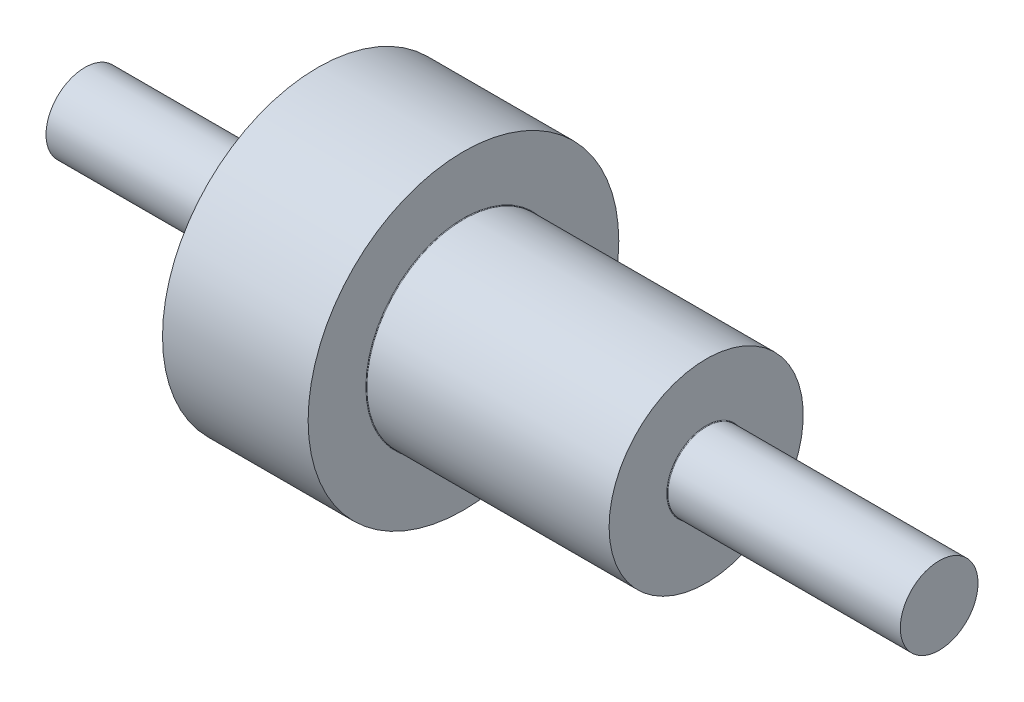
ISO-10303-21;
HEADER;
FILE_DESCRIPTION(('STEP AP214'),'2;1');
FILE_NAME('part.step','',(''),(''),'','','');
FILE_SCHEMA(('AUTOMOTIVE_DESIGN { 1 0 10303 214 1 1 1 1 }'));
ENDSEC;
DATA;
#1=APPLICATION_CONTEXT('core data for automotive mechanical design processes');
#2=APPLICATION_PROTOCOL_DEFINITION('international standard','automotive_design',2000,#1);
#3=PRODUCT_CONTEXT('',#1,'mechanical');
#4=PRODUCT('Part','Part','',(#3));
#5=PRODUCT_RELATED_PRODUCT_CATEGORY('part','',(#4));
#6=PRODUCT_DEFINITION_FORMATION('','',#4);
#7=PRODUCT_DEFINITION_CONTEXT('part definition',#1,'design');
#8=PRODUCT_DEFINITION('design','',#6,#7);
#9=PRODUCT_DEFINITION_SHAPE('','',#8);
#10=(LENGTH_UNIT() NAMED_UNIT(*) SI_UNIT(.MILLI.,.METRE.));
#11=(NAMED_UNIT(*) PLANE_ANGLE_UNIT() SI_UNIT($,.RADIAN.));
#12=(NAMED_UNIT(*) SI_UNIT($,.STERADIAN.) SOLID_ANGLE_UNIT());
#13=UNCERTAINTY_MEASURE_WITH_UNIT(LENGTH_MEASURE(1.E-05),#10,'distance_accuracy_value','');
#14=(GEOMETRIC_REPRESENTATION_CONTEXT(3) GLOBAL_UNCERTAINTY_ASSIGNED_CONTEXT((#13)) GLOBAL_UNIT_ASSIGNED_CONTEXT((#10,
#11,#12)) REPRESENTATION_CONTEXT('',''));
#15=CARTESIAN_POINT('',(0.,0.,0.));
#16=DIRECTION('',(0.,0.,1.));
#17=DIRECTION('',(1.,0.,0.));
#18=AXIS2_PLACEMENT_3D('',#15,#16,#17);
#19=CARTESIAN_POINT('',(0.,0.,0.));
#20=DIRECTION('',(-1.,0.,0.));
#21=DIRECTION('',(0.,0.,1.));
#22=AXIS2_PLACEMENT_3D('',#19,#20,#21);
#23=CYLINDRICAL_SURFACE('',#22,2.);
#24=CARTESIAN_POINT('',(24.03,0.,0.));
#25=DIRECTION('',(-1.,0.,0.));
#26=DIRECTION('',(0.,0.,1.));
#27=AXIS2_PLACEMENT_3D('',#24,#25,#26);
#28=CIRCLE('',#27,2.);
#29=CARTESIAN_POINT('',(24.03,0.,2.));
#30=VERTEX_POINT('',#29);
#31=EDGE_CURVE('E54',#30,#30,#28,.F.);
#32=ORIENTED_EDGE('',*,*,#31,.T.);
#33=EDGE_LOOP('',(#32));
#34=FACE_BOUND('',#33,.T.);
#35=CARTESIAN_POINT('',(36.,0.,0.));
#36=DIRECTION('',(1.,0.,0.));
#37=DIRECTION('',(0.,0.,-1.));
#38=AXIS2_PLACEMENT_3D('',#35,#36,#37);
#39=CIRCLE('',#38,2.);
#40=CARTESIAN_POINT('',(36.,0.,-2.));
#41=VERTEX_POINT('',#40);
#42=EDGE_CURVE('E89',#41,#41,#39,.T.);
#43=ORIENTED_EDGE('',*,*,#42,.F.);
#44=EDGE_LOOP('',(#43));
#45=FACE_BOUND('',#44,.T.);
#46=ADVANCED_FACE('F41',(#34,#45),#23,.T.);
#47=CARTESIAN_POINT('',(24.,2.,0.));
#48=DIRECTION('',(-1.,0.,0.));
#49=DIRECTION('',(0.,0.,1.));
#50=AXIS2_PLACEMENT_3D('',#47,#48,#49);
#51=PLANE('',#50);
#52=CARTESIAN_POINT('',(24.,0.,0.));
#53=DIRECTION('',(-1.,0.,0.));
#54=DIRECTION('',(0.,0.,1.));
#55=AXIS2_PLACEMENT_3D('',#52,#53,#54);
#56=CIRCLE('',#55,2.03);
#57=CARTESIAN_POINT('',(24.,0.,2.03));
#58=VERTEX_POINT('',#57);
#59=EDGE_CURVE('E59',#58,#58,#56,.T.);
#60=ORIENTED_EDGE('',*,*,#59,.T.);
#61=EDGE_LOOP('',(#60));
#62=FACE_BOUND('',#61,.T.);
#63=CARTESIAN_POINT('',(24.,0.,0.));
#64=DIRECTION('',(-1.,0.,0.));
#65=DIRECTION('',(0.,0.,1.));
#66=AXIS2_PLACEMENT_3D('',#63,#64,#65);
#67=CIRCLE('',#66,5.);
#68=CARTESIAN_POINT('',(24.,0.,5.));
#69=VERTEX_POINT('',#68);
#70=EDGE_CURVE('E73',#69,#69,#67,.T.);
#71=ORIENTED_EDGE('',*,*,#70,.F.);
#72=EDGE_LOOP('',(#71));
#73=FACE_BOUND('',#72,.T.);
#74=ADVANCED_FACE('F97',(#62,#73),#51,.F.);
#75=CARTESIAN_POINT('',(0.,0.,0.));
#76=DIRECTION('',(-1.,0.,0.));
#77=DIRECTION('',(0.,0.,1.));
#78=AXIS2_PLACEMENT_3D('',#75,#76,#77);
#79=CYLINDRICAL_SURFACE('',#78,5.);
#80=CARTESIAN_POINT('',(11.53,0.,0.));
#81=DIRECTION('',(-1.,0.,0.));
#82=DIRECTION('',(0.,0.,1.));
#83=AXIS2_PLACEMENT_3D('',#80,#81,#82);
#84=CIRCLE('',#83,5.);
#85=CARTESIAN_POINT('',(11.53,0.,5.));
#86=VERTEX_POINT('',#85);
#87=EDGE_CURVE('E10',#86,#86,#84,.F.);
#88=ORIENTED_EDGE('',*,*,#87,.T.);
#89=EDGE_LOOP('',(#88));
#90=FACE_BOUND('',#89,.T.);
#91=ORIENTED_EDGE('',*,*,#70,.T.);
#92=EDGE_LOOP('',(#91));
#93=FACE_BOUND('',#92,.T.);
#94=ADVANCED_FACE('F103',(#90,#93),#79,.T.);
#95=CARTESIAN_POINT('',(11.5,5.,0.));
#96=DIRECTION('',(-1.,0.,0.));
#97=DIRECTION('',(0.,0.,1.));
#98=AXIS2_PLACEMENT_3D('',#95,#96,#97);
#99=PLANE('',#98);
#100=CARTESIAN_POINT('',(11.5,0.,0.));
#101=DIRECTION('',(-1.,0.,0.));
#102=DIRECTION('',(0.,0.,1.));
#103=AXIS2_PLACEMENT_3D('',#100,#101,#102);
#104=CIRCLE('',#103,5.03);
#105=CARTESIAN_POINT('',(11.5,0.,5.03));
#106=VERTEX_POINT('',#105);
#107=EDGE_CURVE('E49',#106,#106,#104,.T.);
#108=ORIENTED_EDGE('',*,*,#107,.T.);
#109=EDGE_LOOP('',(#108));
#110=FACE_BOUND('',#109,.T.);
#111=CARTESIAN_POINT('',(11.5,0.,0.));
#112=DIRECTION('',(-1.,0.,0.));
#113=DIRECTION('',(0.,0.,1.));
#114=AXIS2_PLACEMENT_3D('',#111,#112,#113);
#115=CIRCLE('',#114,8.);
#116=CARTESIAN_POINT('',(11.5,0.,8.));
#117=VERTEX_POINT('',#116);
#118=EDGE_CURVE('E77',#117,#117,#115,.T.);
#119=ORIENTED_EDGE('',*,*,#118,.F.);
#120=EDGE_LOOP('',(#119));
#121=FACE_BOUND('',#120,.T.);
#122=ADVANCED_FACE('F125',(#110,#121),#99,.F.);
#123=CARTESIAN_POINT('',(0.,0.,0.));
#124=DIRECTION('',(-1.,0.,0.));
#125=DIRECTION('',(0.,0.,1.));
#126=AXIS2_PLACEMENT_3D('',#123,#124,#125);
#127=CYLINDRICAL_SURFACE('',#126,8.);
#128=CARTESIAN_POINT('',(4.,0.,0.));
#129=DIRECTION('',(-1.,0.,0.));
#130=DIRECTION('',(0.,0.,1.));
#131=AXIS2_PLACEMENT_3D('',#128,#129,#130);
#132=CIRCLE('',#131,8.);
#133=CARTESIAN_POINT('',(4.,0.,8.));
#134=VERTEX_POINT('',#133);
#135=EDGE_CURVE('E81',#134,#134,#132,.T.);
#136=ORIENTED_EDGE('',*,*,#135,.F.);
#137=EDGE_LOOP('',(#136));
#138=FACE_BOUND('',#137,.T.);
#139=ORIENTED_EDGE('',*,*,#118,.T.);
#140=EDGE_LOOP('',(#139));
#141=FACE_BOUND('',#140,.T.);
#142=ADVANCED_FACE('F129',(#138,#141),#127,.T.);
#143=CARTESIAN_POINT('',(4.,2.,0.));
#144=DIRECTION('',(1.,0.,0.));
#145=DIRECTION('',(0.,0.,-1.));
#146=AXIS2_PLACEMENT_3D('',#143,#144,#145);
#147=PLANE('',#146);
#148=CARTESIAN_POINT('',(4.,0.,0.));
#149=DIRECTION('',(1.,0.,0.));
#150=DIRECTION('',(0.,0.,-1.));
#151=AXIS2_PLACEMENT_3D('',#148,#149,#150);
#152=CIRCLE('',#151,2.03);
#153=CARTESIAN_POINT('',(4.,0.,-2.03));
#154=VERTEX_POINT('',#153);
#155=EDGE_CURVE('E65',#154,#154,#152,.T.);
#156=ORIENTED_EDGE('',*,*,#155,.T.);
#157=EDGE_LOOP('',(#156));
#158=FACE_BOUND('',#157,.T.);
#159=ORIENTED_EDGE('',*,*,#135,.T.);
#160=EDGE_LOOP('',(#159));
#161=FACE_BOUND('',#160,.T.);
#162=ADVANCED_FACE('F134',(#158,#161),#147,.F.);
#163=CARTESIAN_POINT('',(0.,0.,0.));
#164=DIRECTION('',(-1.,0.,0.));
#165=DIRECTION('',(0.,0.,1.));
#166=AXIS2_PLACEMENT_3D('',#163,#164,#165);
#167=CYLINDRICAL_SURFACE('',#166,2.);
#168=CARTESIAN_POINT('',(3.97,0.,0.));
#169=DIRECTION('',(1.,0.,0.));
#170=DIRECTION('',(0.,0.,-1.));
#171=AXIS2_PLACEMENT_3D('',#168,#169,#170);
#172=CIRCLE('',#171,2.);
#173=CARTESIAN_POINT('',(3.97,0.,-2.));
#174=VERTEX_POINT('',#173);
#175=EDGE_CURVE('E69',#174,#174,#172,.F.);
#176=ORIENTED_EDGE('',*,*,#175,.T.);
#177=EDGE_LOOP('',(#176));
#178=FACE_BOUND('',#177,.T.);
#179=CARTESIAN_POINT('',(-8.,0.,0.));
#180=DIRECTION('',(-1.,0.,0.));
#181=DIRECTION('',(0.,0.,1.));
#182=AXIS2_PLACEMENT_3D('',#179,#180,#181);
#183=CIRCLE('',#182,2.);
#184=CARTESIAN_POINT('',(-8.,0.,2.));
#185=VERTEX_POINT('',#184);
#186=EDGE_CURVE('E85',#185,#185,#183,.T.);
#187=ORIENTED_EDGE('',*,*,#186,.F.);
#188=EDGE_LOOP('',(#187));
#189=FACE_BOUND('',#188,.T.);
#190=ADVANCED_FACE('F138',(#178,#189),#167,.T.);
#191=CARTESIAN_POINT('',(-8.,0.,0.));
#192=DIRECTION('',(-1.,0.,0.));
#193=DIRECTION('',(0.,0.,1.));
#194=AXIS2_PLACEMENT_3D('',#191,#192,#193);
#195=PLANE('',#194);
#196=ORIENTED_EDGE('',*,*,#186,.T.);
#197=EDGE_LOOP('',(#196));
#198=FACE_BOUND('',#197,.T.);
#199=ADVANCED_FACE('F142',(#198),#195,.T.);
#200=CARTESIAN_POINT('',(36.,0.,0.));
#201=DIRECTION('',(1.,0.,0.));
#202=DIRECTION('',(0.,0.,-1.));
#203=AXIS2_PLACEMENT_3D('',#200,#201,#202);
#204=PLANE('',#203);
#205=ORIENTED_EDGE('',*,*,#42,.T.);
#206=EDGE_LOOP('',(#205));
#207=FACE_BOUND('',#206,.T.);
#208=ADVANCED_FACE('F94',(#207),#204,.T.);
#209=CARTESIAN_POINT('',(3.97,0.,0.));
#210=DIRECTION('',(1.,0.,0.));
#211=DIRECTION('',(0.,0.,-1.));
#212=AXIS2_PLACEMENT_3D('',#209,#210,#211);
#213=TOROIDAL_SURFACE('',#212,2.03,0.03);
#214=ORIENTED_EDGE('',*,*,#155,.F.);
#215=EDGE_LOOP('',(#214));
#216=FACE_BOUND('',#215,.T.);
#217=ORIENTED_EDGE('',*,*,#175,.F.);
#218=EDGE_LOOP('',(#217));
#219=FACE_BOUND('',#218,.T.);
#220=ADVANCED_FACE('F108',(#216,#219),#213,.F.);
#221=CARTESIAN_POINT('',(24.03,0.,0.));
#222=DIRECTION('',(-1.,0.,0.));
#223=DIRECTION('',(0.,0.,1.));
#224=AXIS2_PLACEMENT_3D('',#221,#222,#223);
#225=TOROIDAL_SURFACE('',#224,2.03,0.03);
#226=ORIENTED_EDGE('',*,*,#31,.F.);
#227=EDGE_LOOP('',(#226));
#228=FACE_BOUND('',#227,.T.);
#229=ORIENTED_EDGE('',*,*,#59,.F.);
#230=EDGE_LOOP('',(#229));
#231=FACE_BOUND('',#230,.T.);
#232=ADVANCED_FACE('F110',(#228,#231),#225,.F.);
#233=CARTESIAN_POINT('',(11.53,0.,0.));
#234=DIRECTION('',(-1.,0.,0.));
#235=DIRECTION('',(0.,0.,1.));
#236=AXIS2_PLACEMENT_3D('',#233,#234,#235);
#237=TOROIDAL_SURFACE('',#236,5.03,0.03);
#238=ORIENTED_EDGE('',*,*,#87,.F.);
#239=EDGE_LOOP('',(#238));
#240=FACE_BOUND('',#239,.T.);
#241=ORIENTED_EDGE('',*,*,#107,.F.);
#242=EDGE_LOOP('',(#241));
#243=FACE_BOUND('',#242,.T.);
#244=ADVANCED_FACE('F43',(#240,#243),#237,.F.);
#245=CLOSED_SHELL('',(#46,#74,#94,#122,#142,#162,#190,#199,#208,#220,#232,#244));
#246=MANIFOLD_SOLID_BREP('B2',#245);
#247=ADVANCED_BREP_SHAPE_REPRESENTATION('',(#18,#246),#14);
#248=SHAPE_DEFINITION_REPRESENTATION(#9,#247);
ENDSEC;
END-ISO-10303-21;
